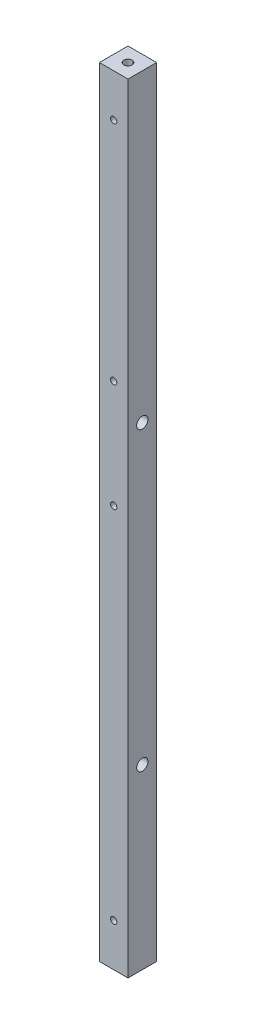
ISO-10303-21;
HEADER;
FILE_DESCRIPTION(('STEP AP214'),'2;1');
FILE_NAME('part.step','',(''),(''),'','','');
FILE_SCHEMA(('AUTOMOTIVE_DESIGN { 1 0 10303 214 1 1 1 1 }'));
ENDSEC;
DATA;
#1=APPLICATION_CONTEXT('core data for automotive mechanical design processes');
#2=APPLICATION_PROTOCOL_DEFINITION('international standard','automotive_design',2000,#1);
#3=PRODUCT_CONTEXT('',#1,'mechanical');
#4=PRODUCT('Part','Part','',(#3));
#5=PRODUCT_RELATED_PRODUCT_CATEGORY('part','',(#4));
#6=PRODUCT_DEFINITION_FORMATION('','',#4);
#7=PRODUCT_DEFINITION_CONTEXT('part definition',#1,'design');
#8=PRODUCT_DEFINITION('design','',#6,#7);
#9=PRODUCT_DEFINITION_SHAPE('','',#8);
#10=(LENGTH_UNIT() NAMED_UNIT(*) SI_UNIT(.MILLI.,.METRE.));
#11=(NAMED_UNIT(*) PLANE_ANGLE_UNIT() SI_UNIT($,.RADIAN.));
#12=(NAMED_UNIT(*) SI_UNIT($,.STERADIAN.) SOLID_ANGLE_UNIT());
#13=UNCERTAINTY_MEASURE_WITH_UNIT(LENGTH_MEASURE(1.E-05),#10,'distance_accuracy_value','');
#14=(GEOMETRIC_REPRESENTATION_CONTEXT(3) GLOBAL_UNCERTAINTY_ASSIGNED_CONTEXT((#13)) GLOBAL_UNIT_ASSIGNED_CONTEXT((#10,
#11,#12)) REPRESENTATION_CONTEXT('',''));
#15=CARTESIAN_POINT('',(0.,0.,0.));
#16=DIRECTION('',(0.,0.,1.));
#17=DIRECTION('',(1.,0.,0.));
#18=AXIS2_PLACEMENT_3D('',#15,#16,#17);
#19=CARTESIAN_POINT('',(5.7,310.,-5.7));
#20=DIRECTION('',(-1.,0.,0.));
#21=DIRECTION('',(0.,0.,1.));
#22=AXIS2_PLACEMENT_3D('',#19,#20,#21);
#23=PLANE('',#22);
#24=CARTESIAN_POINT('',(5.7,188.7,0.));
#25=DIRECTION('',(-1.,0.,0.));
#26=DIRECTION('',(0.,0.,1.));
#27=AXIS2_PLACEMENT_3D('',#24,#25,#26);
#28=CIRCLE('',#27,2.25);
#29=CARTESIAN_POINT('',(5.7,188.7,2.25));
#30=VERTEX_POINT('',#29);
#31=EDGE_CURVE('E186',#30,#30,#28,.T.);
#32=ORIENTED_EDGE('',*,*,#31,.T.);
#33=EDGE_LOOP('',(#32));
#34=FACE_BOUND('',#33,.T.);
#35=CARTESIAN_POINT('',(5.7,70.7,0.));
#36=DIRECTION('',(-1.,0.,0.));
#37=DIRECTION('',(0.,0.,1.));
#38=AXIS2_PLACEMENT_3D('',#35,#36,#37);
#39=CIRCLE('',#38,2.25);
#40=CARTESIAN_POINT('',(5.7,70.7,2.25));
#41=VERTEX_POINT('',#40);
#42=EDGE_CURVE('E106',#41,#41,#39,.T.);
#43=ORIENTED_EDGE('',*,*,#42,.T.);
#44=EDGE_LOOP('',(#43));
#45=FACE_BOUND('',#44,.T.);
#46=DIRECTION('',(0.,0.,-1.));
#47=VECTOR('',#46,1.);
#48=CARTESIAN_POINT('',(5.7,0.,-5.7));
#49=LINE('',#48,#47);
#50=CARTESIAN_POINT('',(5.7,0.,5.7));
#51=VERTEX_POINT('',#50);
#52=CARTESIAN_POINT('',(5.7,0.,-5.7));
#53=VERTEX_POINT('',#52);
#54=EDGE_CURVE('E136',#51,#53,#49,.T.);
#55=ORIENTED_EDGE('',*,*,#54,.T.);
#56=DIRECTION('',(0.,-1.,0.));
#57=VECTOR('',#56,1.);
#58=CARTESIAN_POINT('',(5.7,310.,-5.7));
#59=LINE('',#58,#57);
#60=CARTESIAN_POINT('',(5.7,310.,-5.7));
#61=VERTEX_POINT('',#60);
#62=EDGE_CURVE('E11',#61,#53,#59,.T.);
#63=ORIENTED_EDGE('',*,*,#62,.F.);
#64=DIRECTION('',(0.,0.,-1.));
#65=VECTOR('',#64,1.);
#66=CARTESIAN_POINT('',(5.7,310.,-5.7));
#67=LINE('',#66,#65);
#68=CARTESIAN_POINT('',(5.7,310.,5.7));
#69=VERTEX_POINT('',#68);
#70=EDGE_CURVE('E137',#69,#61,#67,.T.);
#71=ORIENTED_EDGE('',*,*,#70,.F.);
#72=DIRECTION('',(0.,-1.,0.));
#73=VECTOR('',#72,1.);
#74=CARTESIAN_POINT('',(5.7,310.,5.7));
#75=LINE('',#74,#73);
#76=EDGE_CURVE('E143',#69,#51,#75,.T.);
#77=ORIENTED_EDGE('',*,*,#76,.T.);
#78=EDGE_LOOP('',(#55,#63,#71,#77));
#79=FACE_BOUND('',#78,.T.);
#80=ADVANCED_FACE('F35',(#34,#45,#79),#23,.F.);
#81=CARTESIAN_POINT('',(-5.7,310.,-5.7));
#82=DIRECTION('',(0.,0.,1.));
#83=DIRECTION('',(1.,0.,0.));
#84=AXIS2_PLACEMENT_3D('',#81,#82,#83);
#85=PLANE('',#84);
#86=CARTESIAN_POINT('',(0.,293.,-5.7));
#87=DIRECTION('',(0.,0.,1.));
#88=DIRECTION('',(1.,0.,0.));
#89=AXIS2_PLACEMENT_3D('',#86,#87,#88);
#90=CIRCLE('',#89,1.25);
#91=CARTESIAN_POINT('',(1.25,293.,-5.7));
#92=VERTEX_POINT('',#91);
#93=EDGE_CURVE('E115',#92,#92,#90,.T.);
#94=ORIENTED_EDGE('',*,*,#93,.T.);
#95=EDGE_LOOP('',(#94));
#96=FACE_BOUND('',#95,.T.);
#97=CARTESIAN_POINT('',(0.,17.,-5.7));
#98=DIRECTION('',(0.,0.,1.));
#99=DIRECTION('',(1.,0.,0.));
#100=AXIS2_PLACEMENT_3D('',#97,#98,#99);
#101=CIRCLE('',#100,1.25);
#102=CARTESIAN_POINT('',(1.25,17.,-5.7));
#103=VERTEX_POINT('',#102);
#104=EDGE_CURVE('E121',#103,#103,#101,.T.);
#105=ORIENTED_EDGE('',*,*,#104,.T.);
#106=EDGE_LOOP('',(#105));
#107=FACE_BOUND('',#106,.T.);
#108=CARTESIAN_POINT('',(0.,160.,-5.7));
#109=DIRECTION('',(0.,0.,1.));
#110=DIRECTION('',(1.,0.,0.));
#111=AXIS2_PLACEMENT_3D('',#108,#109,#110);
#112=CIRCLE('',#111,1.25);
#113=CARTESIAN_POINT('',(1.25,160.,-5.7));
#114=VERTEX_POINT('',#113);
#115=EDGE_CURVE('E127',#114,#114,#112,.T.);
#116=ORIENTED_EDGE('',*,*,#115,.T.);
#117=EDGE_LOOP('',(#116));
#118=FACE_BOUND('',#117,.T.);
#119=CARTESIAN_POINT('',(0.,203.,-5.7));
#120=DIRECTION('',(0.,0.,1.));
#121=DIRECTION('',(1.,0.,0.));
#122=AXIS2_PLACEMENT_3D('',#119,#120,#121);
#123=CIRCLE('',#122,1.25);
#124=CARTESIAN_POINT('',(1.25,203.,-5.7));
#125=VERTEX_POINT('',#124);
#126=EDGE_CURVE('E133',#125,#125,#123,.T.);
#127=ORIENTED_EDGE('',*,*,#126,.T.);
#128=EDGE_LOOP('',(#127));
#129=FACE_BOUND('',#128,.T.);
#130=DIRECTION('',(-1.,0.,0.));
#131=VECTOR('',#130,1.);
#132=CARTESIAN_POINT('',(-5.7,0.,-5.7));
#133=LINE('',#132,#131);
#134=CARTESIAN_POINT('',(-5.7,0.,-5.7));
#135=VERTEX_POINT('',#134);
#136=EDGE_CURVE('E146',#53,#135,#133,.T.);
#137=ORIENTED_EDGE('',*,*,#136,.T.);
#138=DIRECTION('',(0.,-1.,0.));
#139=VECTOR('',#138,1.);
#140=CARTESIAN_POINT('',(-5.7,310.,-5.7));
#141=LINE('',#140,#139);
#142=CARTESIAN_POINT('',(-5.7,310.,-5.7));
#143=VERTEX_POINT('',#142);
#144=EDGE_CURVE('E43',#143,#135,#141,.T.);
#145=ORIENTED_EDGE('',*,*,#144,.F.);
#146=DIRECTION('',(-1.,0.,0.));
#147=VECTOR('',#146,1.);
#148=CARTESIAN_POINT('',(-5.7,310.,-5.7));
#149=LINE('',#148,#147);
#150=EDGE_CURVE('E82',#61,#143,#149,.T.);
#151=ORIENTED_EDGE('',*,*,#150,.F.);
#152=ORIENTED_EDGE('',*,*,#62,.T.);
#153=EDGE_LOOP('',(#137,#145,#151,#152));
#154=FACE_BOUND('',#153,.T.);
#155=ADVANCED_FACE('F171',(#96,#107,#118,#129,#154),#85,.F.);
#156=CARTESIAN_POINT('',(-5.7,310.,-5.7));
#157=DIRECTION('',(1.,0.,0.));
#158=DIRECTION('',(0.,0.,-1.));
#159=AXIS2_PLACEMENT_3D('',#156,#157,#158);
#160=PLANE('',#159);
#161=CARTESIAN_POINT('',(-5.7,188.7,0.));
#162=DIRECTION('',(-1.,0.,0.));
#163=DIRECTION('',(0.,0.,1.));
#164=AXIS2_PLACEMENT_3D('',#161,#162,#163);
#165=CIRCLE('',#164,2.25);
#166=CARTESIAN_POINT('',(-5.7,188.7,2.25));
#167=VERTEX_POINT('',#166);
#168=EDGE_CURVE('E195',#167,#167,#165,.T.);
#169=ORIENTED_EDGE('',*,*,#168,.F.);
#170=EDGE_LOOP('',(#169));
#171=FACE_BOUND('',#170,.T.);
#172=CARTESIAN_POINT('',(-5.7,70.7,0.));
#173=DIRECTION('',(-1.,0.,0.));
#174=DIRECTION('',(0.,0.,1.));
#175=AXIS2_PLACEMENT_3D('',#172,#173,#174);
#176=CIRCLE('',#175,2.24999999999999);
#177=CARTESIAN_POINT('',(-5.7,70.7,2.24999999999999));
#178=VERTEX_POINT('',#177);
#179=EDGE_CURVE('E190',#178,#178,#176,.T.);
#180=ORIENTED_EDGE('',*,*,#179,.F.);
#181=EDGE_LOOP('',(#180));
#182=FACE_BOUND('',#181,.T.);
#183=DIRECTION('',(0.,0.,1.));
#184=VECTOR('',#183,1.);
#185=CARTESIAN_POINT('',(-5.7,0.,-5.7));
#186=LINE('',#185,#184);
#187=CARTESIAN_POINT('',(-5.7,0.,5.7));
#188=VERTEX_POINT('',#187);
#189=EDGE_CURVE('E69',#135,#188,#186,.T.);
#190=ORIENTED_EDGE('',*,*,#189,.T.);
#191=DIRECTION('',(0.,-1.,0.));
#192=VECTOR('',#191,1.);
#193=CARTESIAN_POINT('',(-5.7,310.,5.7));
#194=LINE('',#193,#192);
#195=CARTESIAN_POINT('',(-5.7,310.,5.7));
#196=VERTEX_POINT('',#195);
#197=EDGE_CURVE('E151',#196,#188,#194,.T.);
#198=ORIENTED_EDGE('',*,*,#197,.F.);
#199=DIRECTION('',(0.,0.,1.));
#200=VECTOR('',#199,1.);
#201=CARTESIAN_POINT('',(-5.7,310.,-5.7));
#202=LINE('',#201,#200);
#203=EDGE_CURVE('E140',#143,#196,#202,.T.);
#204=ORIENTED_EDGE('',*,*,#203,.F.);
#205=ORIENTED_EDGE('',*,*,#144,.T.);
#206=EDGE_LOOP('',(#190,#198,#204,#205));
#207=FACE_BOUND('',#206,.T.);
#208=ADVANCED_FACE('F153',(#171,#182,#207),#160,.F.);
#209=CARTESIAN_POINT('',(-5.7,310.,5.7));
#210=DIRECTION('',(0.,0.,-1.));
#211=DIRECTION('',(-1.,0.,0.));
#212=AXIS2_PLACEMENT_3D('',#209,#210,#211);
#213=PLANE('',#212);
#214=CARTESIAN_POINT('',(0.,293.,5.7));
#215=DIRECTION('',(0.,0.,1.));
#216=DIRECTION('',(1.,0.,0.));
#217=AXIS2_PLACEMENT_3D('',#214,#215,#216);
#218=CIRCLE('',#217,1.24999999999999);
#219=CARTESIAN_POINT('',(1.24999999999999,293.,5.7));
#220=VERTEX_POINT('',#219);
#221=EDGE_CURVE('E112',#220,#220,#218,.T.);
#222=ORIENTED_EDGE('',*,*,#221,.F.);
#223=EDGE_LOOP('',(#222));
#224=FACE_BOUND('',#223,.T.);
#225=CARTESIAN_POINT('',(0.,17.,5.7));
#226=DIRECTION('',(0.,0.,1.));
#227=DIRECTION('',(1.,0.,0.));
#228=AXIS2_PLACEMENT_3D('',#225,#226,#227);
#229=CIRCLE('',#228,1.24999999999999);
#230=CARTESIAN_POINT('',(1.24999999999999,17.,5.7));
#231=VERTEX_POINT('',#230);
#232=EDGE_CURVE('E118',#231,#231,#229,.T.);
#233=ORIENTED_EDGE('',*,*,#232,.F.);
#234=EDGE_LOOP('',(#233));
#235=FACE_BOUND('',#234,.T.);
#236=CARTESIAN_POINT('',(0.,160.,5.7));
#237=DIRECTION('',(0.,0.,1.));
#238=DIRECTION('',(1.,0.,0.));
#239=AXIS2_PLACEMENT_3D('',#236,#237,#238);
#240=CIRCLE('',#239,1.24999999999999);
#241=CARTESIAN_POINT('',(1.24999999999999,160.,5.7));
#242=VERTEX_POINT('',#241);
#243=EDGE_CURVE('E124',#242,#242,#240,.T.);
#244=ORIENTED_EDGE('',*,*,#243,.F.);
#245=EDGE_LOOP('',(#244));
#246=FACE_BOUND('',#245,.T.);
#247=CARTESIAN_POINT('',(0.,203.,5.7));
#248=DIRECTION('',(0.,0.,1.));
#249=DIRECTION('',(1.,0.,0.));
#250=AXIS2_PLACEMENT_3D('',#247,#248,#249);
#251=CIRCLE('',#250,1.24999999999999);
#252=CARTESIAN_POINT('',(1.24999999999999,203.,5.7));
#253=VERTEX_POINT('',#252);
#254=EDGE_CURVE('E130',#253,#253,#251,.T.);
#255=ORIENTED_EDGE('',*,*,#254,.F.);
#256=EDGE_LOOP('',(#255));
#257=FACE_BOUND('',#256,.T.);
#258=DIRECTION('',(1.,0.,0.));
#259=VECTOR('',#258,1.);
#260=CARTESIAN_POINT('',(-5.7,0.,5.7));
#261=LINE('',#260,#259);
#262=EDGE_CURVE('E75',#188,#51,#261,.T.);
#263=ORIENTED_EDGE('',*,*,#262,.T.);
#264=ORIENTED_EDGE('',*,*,#76,.F.);
#265=DIRECTION('',(1.,0.,0.));
#266=VECTOR('',#265,1.);
#267=CARTESIAN_POINT('',(-5.7,310.,5.7));
#268=LINE('',#267,#266);
#269=EDGE_CURVE('E51',#196,#69,#268,.T.);
#270=ORIENTED_EDGE('',*,*,#269,.F.);
#271=ORIENTED_EDGE('',*,*,#197,.T.);
#272=EDGE_LOOP('',(#263,#264,#270,#271));
#273=FACE_BOUND('',#272,.T.);
#274=ADVANCED_FACE('F160',(#224,#235,#246,#257,#273),#213,.F.);
#275=CARTESIAN_POINT('',(5.7,310.,5.7));
#276=DIRECTION('',(0.,1.,0.));
#277=DIRECTION('',(0.,0.,1.));
#278=AXIS2_PLACEMENT_3D('',#275,#276,#277);
#279=PLANE('',#278);
#280=CARTESIAN_POINT('',(0.,310.,0.));
#281=DIRECTION('',(0.,1.,0.));
#282=DIRECTION('',(0.,0.,1.));
#283=AXIS2_PLACEMENT_3D('',#280,#281,#282);
#284=CIRCLE('',#283,1.65);
#285=CARTESIAN_POINT('',(0.,310.,1.65));
#286=VERTEX_POINT('',#285);
#287=EDGE_CURVE('E99',#286,#286,#284,.T.);
#288=ORIENTED_EDGE('',*,*,#287,.F.);
#289=EDGE_LOOP('',(#288));
#290=FACE_BOUND('',#289,.T.);
#291=ORIENTED_EDGE('',*,*,#70,.T.);
#292=ORIENTED_EDGE('',*,*,#150,.T.);
#293=ORIENTED_EDGE('',*,*,#203,.T.);
#294=ORIENTED_EDGE('',*,*,#269,.T.);
#295=EDGE_LOOP('',(#291,#292,#293,#294));
#296=FACE_BOUND('',#295,.T.);
#297=ADVANCED_FACE('F162',(#290,#296),#279,.T.);
#298=CARTESIAN_POINT('',(5.7,0.,5.7));
#299=DIRECTION('',(0.,1.,0.));
#300=DIRECTION('',(0.,0.,1.));
#301=AXIS2_PLACEMENT_3D('',#298,#299,#300);
#302=PLANE('',#301);
#303=CARTESIAN_POINT('',(0.,0.,0.));
#304=DIRECTION('',(0.,-1.,0.));
#305=DIRECTION('',(0.,0.,-1.));
#306=AXIS2_PLACEMENT_3D('',#303,#304,#305);
#307=CIRCLE('',#306,1.64999999999999);
#308=CARTESIAN_POINT('',(0.,0.,-1.64999999999999));
#309=VERTEX_POINT('',#308);
#310=EDGE_CURVE('E100',#309,#309,#307,.T.);
#311=ORIENTED_EDGE('',*,*,#310,.F.);
#312=EDGE_LOOP('',(#311));
#313=FACE_BOUND('',#312,.T.);
#314=ORIENTED_EDGE('',*,*,#54,.F.);
#315=ORIENTED_EDGE('',*,*,#262,.F.);
#316=ORIENTED_EDGE('',*,*,#189,.F.);
#317=ORIENTED_EDGE('',*,*,#136,.F.);
#318=EDGE_LOOP('',(#314,#315,#316,#317));
#319=FACE_BOUND('',#318,.T.);
#320=ADVANCED_FACE('F156',(#313,#319),#302,.F.);
#321=CARTESIAN_POINT('',(0.,203.,5.7));
#322=DIRECTION('',(0.,0.,1.));
#323=DIRECTION('',(1.,0.,0.));
#324=AXIS2_PLACEMENT_3D('',#321,#322,#323);
#325=CYLINDRICAL_SURFACE('',#324,1.24999999999999);
#326=ORIENTED_EDGE('',*,*,#126,.F.);
#327=EDGE_LOOP('',(#326));
#328=FACE_BOUND('',#327,.T.);
#329=ORIENTED_EDGE('',*,*,#254,.T.);
#330=EDGE_LOOP('',(#329));
#331=FACE_BOUND('',#330,.T.);
#332=ADVANCED_FACE('F232',(#328,#331),#325,.F.);
#333=CARTESIAN_POINT('',(0.,160.,5.7));
#334=DIRECTION('',(0.,0.,1.));
#335=DIRECTION('',(1.,0.,0.));
#336=AXIS2_PLACEMENT_3D('',#333,#334,#335);
#337=CYLINDRICAL_SURFACE('',#336,1.24999999999999);
#338=ORIENTED_EDGE('',*,*,#115,.F.);
#339=EDGE_LOOP('',(#338));
#340=FACE_BOUND('',#339,.T.);
#341=ORIENTED_EDGE('',*,*,#243,.T.);
#342=EDGE_LOOP('',(#341));
#343=FACE_BOUND('',#342,.T.);
#344=ADVANCED_FACE('F228',(#340,#343),#337,.F.);
#345=CARTESIAN_POINT('',(0.,17.,5.7));
#346=DIRECTION('',(0.,0.,1.));
#347=DIRECTION('',(1.,0.,0.));
#348=AXIS2_PLACEMENT_3D('',#345,#346,#347);
#349=CYLINDRICAL_SURFACE('',#348,1.24999999999999);
#350=ORIENTED_EDGE('',*,*,#104,.F.);
#351=EDGE_LOOP('',(#350));
#352=FACE_BOUND('',#351,.T.);
#353=ORIENTED_EDGE('',*,*,#232,.T.);
#354=EDGE_LOOP('',(#353));
#355=FACE_BOUND('',#354,.T.);
#356=ADVANCED_FACE('F224',(#352,#355),#349,.F.);
#357=CARTESIAN_POINT('',(0.,293.,5.7));
#358=DIRECTION('',(0.,0.,1.));
#359=DIRECTION('',(1.,0.,0.));
#360=AXIS2_PLACEMENT_3D('',#357,#358,#359);
#361=CYLINDRICAL_SURFACE('',#360,1.24999999999999);
#362=ORIENTED_EDGE('',*,*,#93,.F.);
#363=EDGE_LOOP('',(#362));
#364=FACE_BOUND('',#363,.T.);
#365=ORIENTED_EDGE('',*,*,#221,.T.);
#366=EDGE_LOOP('',(#365));
#367=FACE_BOUND('',#366,.T.);
#368=ADVANCED_FACE('F220',(#364,#367),#361,.F.);
#369=CARTESIAN_POINT('',(0.,298.5,0.));
#370=DIRECTION('',(0.,1.,0.));
#371=DIRECTION('',(0.,0.,1.));
#372=AXIS2_PLACEMENT_3D('',#369,#370,#371);
#373=CONICAL_SURFACE('',#372,1.65,1.02974425867666);
#374=CARTESIAN_POINT('',(0.,297.508579978605,0.));
#375=VERTEX_POINT('',#374);
#376=VERTEX_LOOP('',#375);
#377=FACE_BOUND('',#376,.T.);
#378=CARTESIAN_POINT('',(0.,298.5,0.));
#379=DIRECTION('',(0.,1.,0.));
#380=DIRECTION('',(0.,0.,1.));
#381=AXIS2_PLACEMENT_3D('',#378,#379,#380);
#382=CIRCLE('',#381,1.65);
#383=CARTESIAN_POINT('',(0.,298.5,1.65));
#384=VERTEX_POINT('',#383);
#385=EDGE_CURVE('E103',#384,#384,#382,.T.);
#386=ORIENTED_EDGE('',*,*,#385,.T.);
#387=EDGE_LOOP('',(#386));
#388=FACE_BOUND('',#387,.T.);
#389=ADVANCED_FACE('F216',(#377,#388),#373,.F.);
#390=CARTESIAN_POINT('',(0.,310.,0.));
#391=DIRECTION('',(0.,1.,0.));
#392=DIRECTION('',(0.,0.,1.));
#393=AXIS2_PLACEMENT_3D('',#390,#391,#392);
#394=CYLINDRICAL_SURFACE('',#393,1.65);
#395=ORIENTED_EDGE('',*,*,#385,.F.);
#396=EDGE_LOOP('',(#395));
#397=FACE_BOUND('',#396,.T.);
#398=ORIENTED_EDGE('',*,*,#287,.T.);
#399=EDGE_LOOP('',(#398));
#400=FACE_BOUND('',#399,.T.);
#401=ADVANCED_FACE('F93',(#397,#400),#394,.F.);
#402=CARTESIAN_POINT('',(0.,11.5,0.));
#403=DIRECTION('',(0.,-1.,0.));
#404=DIRECTION('',(0.,0.,-1.));
#405=AXIS2_PLACEMENT_3D('',#402,#403,#404);
#406=CONICAL_SURFACE('',#405,1.64999999999999,1.02974425867665);
#407=CARTESIAN_POINT('',(0.,12.4914200213955,0.));
#408=VERTEX_POINT('',#407);
#409=VERTEX_LOOP('',#408);
#410=FACE_BOUND('',#409,.T.);
#411=CARTESIAN_POINT('',(0.,11.5,0.));
#412=DIRECTION('',(0.,-1.,0.));
#413=DIRECTION('',(0.,0.,-1.));
#414=AXIS2_PLACEMENT_3D('',#411,#412,#413);
#415=CIRCLE('',#414,1.64999999999999);
#416=CARTESIAN_POINT('',(0.,11.5,-1.64999999999999));
#417=VERTEX_POINT('',#416);
#418=EDGE_CURVE('E97',#417,#417,#415,.T.);
#419=ORIENTED_EDGE('',*,*,#418,.T.);
#420=EDGE_LOOP('',(#419));
#421=FACE_BOUND('',#420,.T.);
#422=ADVANCED_FACE('F89',(#410,#421),#406,.F.);
#423=CARTESIAN_POINT('',(0.,0.,0.));
#424=DIRECTION('',(0.,-1.,0.));
#425=DIRECTION('',(0.,0.,-1.));
#426=AXIS2_PLACEMENT_3D('',#423,#424,#425);
#427=CYLINDRICAL_SURFACE('',#426,1.64999999999999);
#428=ORIENTED_EDGE('',*,*,#418,.F.);
#429=EDGE_LOOP('',(#428));
#430=FACE_BOUND('',#429,.T.);
#431=ORIENTED_EDGE('',*,*,#310,.T.);
#432=EDGE_LOOP('',(#431));
#433=FACE_BOUND('',#432,.T.);
#434=ADVANCED_FACE('F92',(#430,#433),#427,.F.);
#435=CARTESIAN_POINT('',(-5.7,70.7,0.));
#436=DIRECTION('',(-1.,0.,0.));
#437=DIRECTION('',(0.,0.,1.));
#438=AXIS2_PLACEMENT_3D('',#435,#436,#437);
#439=CYLINDRICAL_SURFACE('',#438,2.25);
#440=ORIENTED_EDGE('',*,*,#42,.F.);
#441=EDGE_LOOP('',(#440));
#442=FACE_BOUND('',#441,.T.);
#443=ORIENTED_EDGE('',*,*,#179,.T.);
#444=EDGE_LOOP('',(#443));
#445=FACE_BOUND('',#444,.T.);
#446=ADVANCED_FACE('F203',(#442,#445),#439,.F.);
#447=CARTESIAN_POINT('',(-5.7,188.7,0.));
#448=DIRECTION('',(-1.,0.,0.));
#449=DIRECTION('',(0.,0.,1.));
#450=AXIS2_PLACEMENT_3D('',#447,#448,#449);
#451=CYLINDRICAL_SURFACE('',#450,2.25);
#452=ORIENTED_EDGE('',*,*,#31,.F.);
#453=EDGE_LOOP('',(#452));
#454=FACE_BOUND('',#453,.T.);
#455=ORIENTED_EDGE('',*,*,#168,.T.);
#456=EDGE_LOOP('',(#455));
#457=FACE_BOUND('',#456,.T.);
#458=ADVANCED_FACE('F199',(#454,#457),#451,.F.);
#459=CLOSED_SHELL('',(#80,#155,#208,#274,#297,#320,#332,#344,#356,#368,#389,#401,#422,#434,#446,#458));
#460=MANIFOLD_SOLID_BREP('B2',#459);
#461=ADVANCED_BREP_SHAPE_REPRESENTATION('',(#18,#460),#14);
#462=SHAPE_DEFINITION_REPRESENTATION(#9,#461);
ENDSEC;
END-ISO-10303-21;
